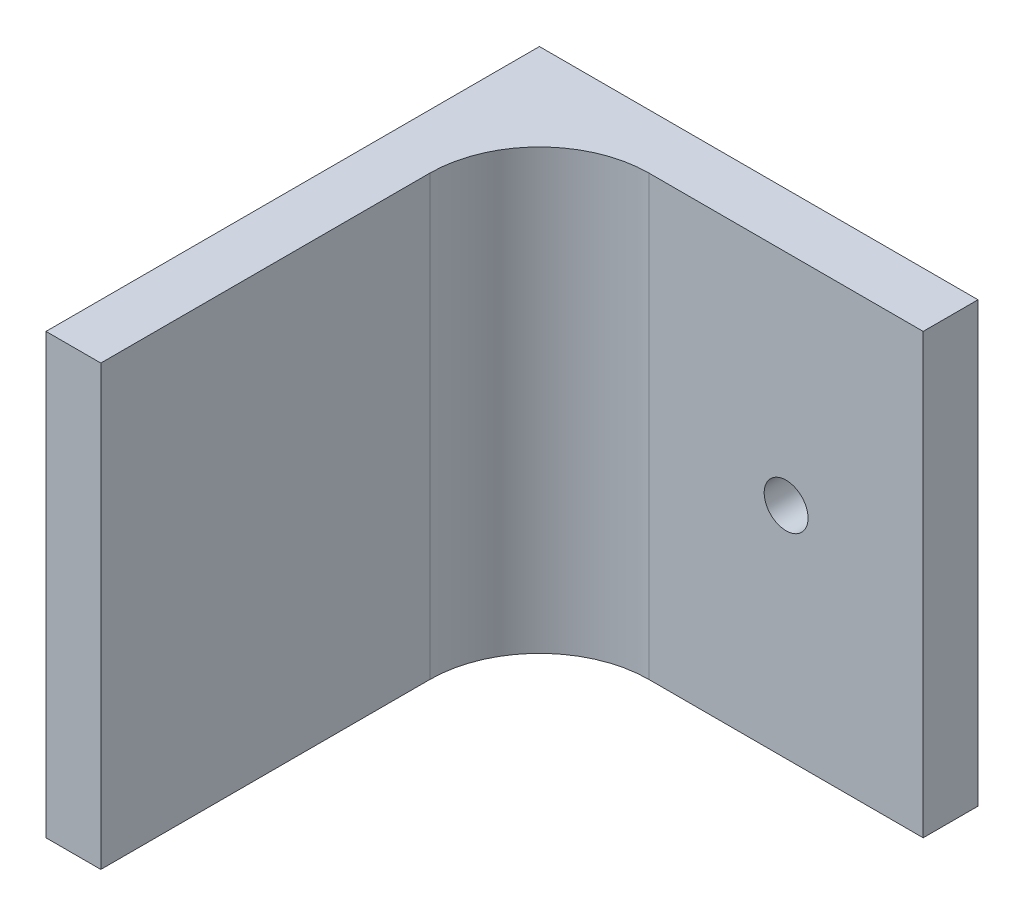
ISO-10303-21;
HEADER;
FILE_DESCRIPTION(('STEP AP214'),'2;1');
FILE_NAME('part.step','',(''),(''),'','','');
FILE_SCHEMA(('AUTOMOTIVE_DESIGN { 1 0 10303 214 1 1 1 1 }'));
ENDSEC;
DATA;
#1=APPLICATION_CONTEXT('core data for automotive mechanical design processes');
#2=APPLICATION_PROTOCOL_DEFINITION('international standard','automotive_design',2000,#1);
#3=PRODUCT_CONTEXT('',#1,'mechanical');
#4=PRODUCT('Part','Part','',(#3));
#5=PRODUCT_RELATED_PRODUCT_CATEGORY('part','',(#4));
#6=PRODUCT_DEFINITION_FORMATION('','',#4);
#7=PRODUCT_DEFINITION_CONTEXT('part definition',#1,'design');
#8=PRODUCT_DEFINITION('design','',#6,#7);
#9=PRODUCT_DEFINITION_SHAPE('','',#8);
#10=(LENGTH_UNIT() NAMED_UNIT(*) SI_UNIT(.MILLI.,.METRE.));
#11=(NAMED_UNIT(*) PLANE_ANGLE_UNIT() SI_UNIT($,.RADIAN.));
#12=(NAMED_UNIT(*) SI_UNIT($,.STERADIAN.) SOLID_ANGLE_UNIT());
#13=UNCERTAINTY_MEASURE_WITH_UNIT(LENGTH_MEASURE(1.E-05),#10,'distance_accuracy_value','');
#14=(GEOMETRIC_REPRESENTATION_CONTEXT(3) GLOBAL_UNCERTAINTY_ASSIGNED_CONTEXT((#13)) GLOBAL_UNIT_ASSIGNED_CONTEXT((#10,
#11,#12)) REPRESENTATION_CONTEXT('',''));
#15=CARTESIAN_POINT('',(0.,0.,0.));
#16=DIRECTION('',(0.,0.,1.));
#17=DIRECTION('',(1.,0.,0.));
#18=AXIS2_PLACEMENT_3D('',#15,#16,#17);
#19=CARTESIAN_POINT('',(0.,0.,2.5));
#20=DIRECTION('',(0.,0.,1.));
#21=DIRECTION('',(1.,0.,0.));
#22=AXIS2_PLACEMENT_3D('',#19,#20,#21);
#23=PLANE('',#22);
#24=CARTESIAN_POINT('',(81.7489565352814,8.48481034737446,2.5));
#25=DIRECTION('',(0.,0.,1.));
#26=DIRECTION('',(1.,0.,0.));
#27=AXIS2_PLACEMENT_3D('',#24,#25,#26);
#28=CIRCLE('',#27,0.999999999999998);
#29=CARTESIAN_POINT('',(82.7489565352814,8.48481034737446,2.5));
#30=VERTEX_POINT('',#29);
#31=EDGE_CURVE('E118',#30,#30,#28,.T.);
#32=ORIENTED_EDGE('',*,*,#31,.F.);
#33=EDGE_LOOP('',(#32));
#34=FACE_BOUND('',#33,.T.);
#35=DIRECTION('',(-1.,0.,0.));
#36=VECTOR('',#35,1.);
#37=CARTESIAN_POINT('',(67.9989565352814,18.4848103473745,2.5));
#38=LINE('',#37,#36);
#39=CARTESIAN_POINT('',(87.9989565352814,18.4848103473745,2.5));
#40=VERTEX_POINT('',#39);
#41=CARTESIAN_POINT('',(75.4989565352814,18.4848103473745,2.5));
#42=VERTEX_POINT('',#41);
#43=EDGE_CURVE('E131',#40,#42,#38,.T.);
#44=ORIENTED_EDGE('',*,*,#43,.T.);
#45=DIRECTION('',(0.,-1.,0.));
#46=VECTOR('',#45,1.);
#47=CARTESIAN_POINT('',(75.4989565352814,0.,2.5));
#48=LINE('',#47,#46);
#49=CARTESIAN_POINT('',(75.4989565352814,-1.51518965262554,2.5));
#50=VERTEX_POINT('',#49);
#51=EDGE_CURVE('E102',#42,#50,#48,.T.);
#52=ORIENTED_EDGE('',*,*,#51,.T.);
#53=DIRECTION('',(1.,0.,0.));
#54=VECTOR('',#53,1.);
#55=CARTESIAN_POINT('',(67.9989565352814,-1.51518965262554,2.5));
#56=LINE('',#55,#54);
#57=CARTESIAN_POINT('',(87.9989565352814,-1.51518965262554,2.5));
#58=VERTEX_POINT('',#57);
#59=EDGE_CURVE('E126',#50,#58,#56,.T.);
#60=ORIENTED_EDGE('',*,*,#59,.T.);
#61=DIRECTION('',(0.,1.,0.));
#62=VECTOR('',#61,1.);
#63=CARTESIAN_POINT('',(87.9989565352814,18.4848103473745,2.5));
#64=LINE('',#63,#62);
#65=EDGE_CURVE('E128',#58,#40,#64,.T.);
#66=ORIENTED_EDGE('',*,*,#65,.T.);
#67=EDGE_LOOP('',(#44,#52,#60,#66));
#68=FACE_BOUND('',#67,.T.);
#69=ADVANCED_FACE('F33',(#34,#68),#23,.T.);
#70=CARTESIAN_POINT('',(67.9989565352814,18.4848103473745,2.5));
#71=DIRECTION('',(1.,0.,0.));
#72=DIRECTION('',(0.,0.,-1.));
#73=AXIS2_PLACEMENT_3D('',#70,#71,#72);
#74=PLANE('',#73);
#75=DIRECTION('',(0.,-1.,0.));
#76=VECTOR('',#75,1.);
#77=CARTESIAN_POINT('',(67.9989565352814,18.4848103473745,0.));
#78=LINE('',#77,#76);
#79=CARTESIAN_POINT('',(67.9989565352814,18.4848103473745,0.));
#80=VERTEX_POINT('',#79);
#81=CARTESIAN_POINT('',(67.9989565352814,-1.51518965262554,0.));
#82=VERTEX_POINT('',#81);
#83=EDGE_CURVE('E101',#80,#82,#78,.T.);
#84=ORIENTED_EDGE('',*,*,#83,.T.);
#85=DIRECTION('',(0.,0.,-1.));
#86=VECTOR('',#85,1.);
#87=CARTESIAN_POINT('',(67.9989565352814,-1.51518965262554,2.5));
#88=LINE('',#87,#86);
#89=CARTESIAN_POINT('',(67.9989565352814,-1.51518965262554,22.5));
#90=VERTEX_POINT('',#89);
#91=EDGE_CURVE('E94',#90,#82,#88,.T.);
#92=ORIENTED_EDGE('',*,*,#91,.F.);
#93=DIRECTION('',(0.,-1.,0.));
#94=VECTOR('',#93,1.);
#95=CARTESIAN_POINT('',(67.9989565352814,-1.51518965262554,22.5));
#96=LINE('',#95,#94);
#97=CARTESIAN_POINT('',(67.9989565352814,18.4848103473745,22.5));
#98=VERTEX_POINT('',#97);
#99=EDGE_CURVE('E99',#98,#90,#96,.T.);
#100=ORIENTED_EDGE('',*,*,#99,.F.);
#101=DIRECTION('',(0.,0.,-1.));
#102=VECTOR('',#101,1.);
#103=CARTESIAN_POINT('',(67.9989565352814,18.4848103473745,2.5));
#104=LINE('',#103,#102);
#105=EDGE_CURVE('E134',#98,#80,#104,.T.);
#106=ORIENTED_EDGE('',*,*,#105,.T.);
#107=EDGE_LOOP('',(#84,#92,#100,#106));
#108=FACE_BOUND('',#107,.T.);
#109=ADVANCED_FACE('F96',(#108),#74,.F.);
#110=CARTESIAN_POINT('',(67.9989565352814,-1.51518965262554,2.5));
#111=DIRECTION('',(0.,1.,0.));
#112=DIRECTION('',(-1.,0.,0.));
#113=AXIS2_PLACEMENT_3D('',#110,#111,#112);
#114=PLANE('',#113);
#115=DIRECTION('',(1.,0.,0.));
#116=VECTOR('',#115,1.);
#117=CARTESIAN_POINT('',(67.9989565352814,-1.51518965262554,0.));
#118=LINE('',#117,#116);
#119=CARTESIAN_POINT('',(87.9989565352814,-1.51518965262554,0.));
#120=VERTEX_POINT('',#119);
#121=EDGE_CURVE('E136',#82,#120,#118,.T.);
#122=ORIENTED_EDGE('',*,*,#121,.T.);
#123=DIRECTION('',(0.,0.,-1.));
#124=VECTOR('',#123,1.);
#125=CARTESIAN_POINT('',(87.9989565352814,-1.51518965262554,2.5));
#126=LINE('',#125,#124);
#127=EDGE_CURVE('E103',#58,#120,#126,.T.);
#128=ORIENTED_EDGE('',*,*,#127,.F.);
#129=ORIENTED_EDGE('',*,*,#59,.F.);
#130=CARTESIAN_POINT('',(75.4989565352814,-1.51518965262554,7.5));
#131=DIRECTION('',(0.,1.,0.));
#132=DIRECTION('',(-1.,0.,0.));
#133=AXIS2_PLACEMENT_3D('',#130,#131,#132);
#134=CIRCLE('',#133,5.);
#135=CARTESIAN_POINT('',(70.4989565352814,-1.51518965262554,7.5));
#136=VERTEX_POINT('',#135);
#137=EDGE_CURVE('E42',#50,#136,#134,.T.);
#138=ORIENTED_EDGE('',*,*,#137,.T.);
#139=DIRECTION('',(0.,0.,-1.));
#140=VECTOR('',#139,1.);
#141=CARTESIAN_POINT('',(70.4989565352814,-1.51518965262554,22.5));
#142=LINE('',#141,#140);
#143=CARTESIAN_POINT('',(70.4989565352814,-1.51518965262554,22.5));
#144=VERTEX_POINT('',#143);
#145=EDGE_CURVE('E107',#144,#136,#142,.T.);
#146=ORIENTED_EDGE('',*,*,#145,.F.);
#147=DIRECTION('',(1.,0.,0.));
#148=VECTOR('',#147,1.);
#149=CARTESIAN_POINT('',(67.9989565352814,-1.51518965262554,22.5));
#150=LINE('',#149,#148);
#151=EDGE_CURVE('E105',#90,#144,#150,.T.);
#152=ORIENTED_EDGE('',*,*,#151,.F.);
#153=ORIENTED_EDGE('',*,*,#91,.T.);
#154=EDGE_LOOP('',(#122,#128,#129,#138,#146,#152,#153));
#155=FACE_BOUND('',#154,.T.);
#156=ADVANCED_FACE('F106',(#155),#114,.F.);
#157=CARTESIAN_POINT('',(87.9989565352814,18.4848103473745,2.5));
#158=DIRECTION('',(-1.,0.,0.));
#159=DIRECTION('',(0.,0.,1.));
#160=AXIS2_PLACEMENT_3D('',#157,#158,#159);
#161=PLANE('',#160);
#162=DIRECTION('',(0.,1.,0.));
#163=VECTOR('',#162,1.);
#164=CARTESIAN_POINT('',(87.9989565352814,18.4848103473745,0.));
#165=LINE('',#164,#163);
#166=CARTESIAN_POINT('',(87.9989565352814,18.4848103473745,0.));
#167=VERTEX_POINT('',#166);
#168=EDGE_CURVE('E138',#120,#167,#165,.T.);
#169=ORIENTED_EDGE('',*,*,#168,.T.);
#170=DIRECTION('',(0.,0.,-1.));
#171=VECTOR('',#170,1.);
#172=CARTESIAN_POINT('',(87.9989565352814,18.4848103473745,2.5));
#173=LINE('',#172,#171);
#174=EDGE_CURVE('E142',#40,#167,#173,.T.);
#175=ORIENTED_EDGE('',*,*,#174,.F.);
#176=ORIENTED_EDGE('',*,*,#65,.F.);
#177=ORIENTED_EDGE('',*,*,#127,.T.);
#178=EDGE_LOOP('',(#169,#175,#176,#177));
#179=FACE_BOUND('',#178,.T.);
#180=ADVANCED_FACE('F160',(#179),#161,.F.);
#181=CARTESIAN_POINT('',(67.9989565352814,18.4848103473745,2.5));
#182=DIRECTION('',(0.,-1.,0.));
#183=DIRECTION('',(0.,0.,-1.));
#184=AXIS2_PLACEMENT_3D('',#181,#182,#183);
#185=PLANE('',#184);
#186=ORIENTED_EDGE('',*,*,#105,.F.);
#187=DIRECTION('',(-1.,0.,0.));
#188=VECTOR('',#187,1.);
#189=CARTESIAN_POINT('',(67.9989565352814,18.4848103473745,22.5));
#190=LINE('',#189,#188);
#191=CARTESIAN_POINT('',(70.4989565352814,18.4848103473745,22.5));
#192=VERTEX_POINT('',#191);
#193=EDGE_CURVE('E115',#192,#98,#190,.T.);
#194=ORIENTED_EDGE('',*,*,#193,.F.);
#195=DIRECTION('',(0.,0.,-1.));
#196=VECTOR('',#195,1.);
#197=CARTESIAN_POINT('',(70.4989565352814,18.4848103473745,22.5));
#198=LINE('',#197,#196);
#199=CARTESIAN_POINT('',(70.4989565352814,18.4848103473745,7.5));
#200=VERTEX_POINT('',#199);
#201=EDGE_CURVE('E123',#192,#200,#198,.T.);
#202=ORIENTED_EDGE('',*,*,#201,.T.);
#203=CARTESIAN_POINT('',(75.4989565352814,18.4848103473745,7.5));
#204=DIRECTION('',(0.,-1.,0.));
#205=DIRECTION('',(0.,0.,-1.));
#206=AXIS2_PLACEMENT_3D('',#203,#204,#205);
#207=CIRCLE('',#206,5.);
#208=EDGE_CURVE('E11',#200,#42,#207,.T.);
#209=ORIENTED_EDGE('',*,*,#208,.T.);
#210=ORIENTED_EDGE('',*,*,#43,.F.);
#211=ORIENTED_EDGE('',*,*,#174,.T.);
#212=DIRECTION('',(-1.,0.,0.));
#213=VECTOR('',#212,1.);
#214=CARTESIAN_POINT('',(67.9989565352814,18.4848103473745,0.));
#215=LINE('',#214,#213);
#216=EDGE_CURVE('E129',#167,#80,#215,.T.);
#217=ORIENTED_EDGE('',*,*,#216,.T.);
#218=EDGE_LOOP('',(#186,#194,#202,#209,#210,#211,#217));
#219=FACE_BOUND('',#218,.T.);
#220=ADVANCED_FACE('F163',(#219),#185,.F.);
#221=CARTESIAN_POINT('',(0.,0.,0.));
#222=DIRECTION('',(0.,0.,1.));
#223=DIRECTION('',(1.,0.,0.));
#224=AXIS2_PLACEMENT_3D('',#221,#222,#223);
#225=PLANE('',#224);
#226=CARTESIAN_POINT('',(81.7489565352814,8.48481034737446,0.));
#227=DIRECTION('',(0.,0.,1.));
#228=DIRECTION('',(1.,0.,0.));
#229=AXIS2_PLACEMENT_3D('',#226,#227,#228);
#230=CIRCLE('',#229,0.999999999999998);
#231=CARTESIAN_POINT('',(82.7489565352814,8.48481034737446,0.));
#232=VERTEX_POINT('',#231);
#233=EDGE_CURVE('E37',#232,#232,#230,.T.);
#234=ORIENTED_EDGE('',*,*,#233,.T.);
#235=EDGE_LOOP('',(#234));
#236=FACE_BOUND('',#235,.T.);
#237=ORIENTED_EDGE('',*,*,#83,.F.);
#238=ORIENTED_EDGE('',*,*,#216,.F.);
#239=ORIENTED_EDGE('',*,*,#168,.F.);
#240=ORIENTED_EDGE('',*,*,#121,.F.);
#241=EDGE_LOOP('',(#237,#238,#239,#240));
#242=FACE_BOUND('',#241,.T.);
#243=ADVANCED_FACE('F183',(#236,#242),#225,.F.);
#244=CARTESIAN_POINT('',(70.4989565352814,-1.51518965262554,22.5));
#245=DIRECTION('',(-1.,0.,0.));
#246=DIRECTION('',(0.,0.,1.));
#247=AXIS2_PLACEMENT_3D('',#244,#245,#246);
#248=PLANE('',#247);
#249=ORIENTED_EDGE('',*,*,#145,.T.);
#250=DIRECTION('',(0.,-1.,0.));
#251=VECTOR('',#250,1.);
#252=CARTESIAN_POINT('',(70.4989565352814,-1.51518965262554,7.5));
#253=LINE('',#252,#251);
#254=EDGE_CURVE('E55',#136,#200,#253,.F.);
#255=ORIENTED_EDGE('',*,*,#254,.T.);
#256=ORIENTED_EDGE('',*,*,#201,.F.);
#257=DIRECTION('',(0.,1.,0.));
#258=VECTOR('',#257,1.);
#259=CARTESIAN_POINT('',(70.4989565352814,-1.51518965262554,22.5));
#260=LINE('',#259,#258);
#261=EDGE_CURVE('E110',#144,#192,#260,.T.);
#262=ORIENTED_EDGE('',*,*,#261,.F.);
#263=EDGE_LOOP('',(#249,#255,#256,#262));
#264=FACE_BOUND('',#263,.T.);
#265=ADVANCED_FACE('F172',(#264),#248,.F.);
#266=CARTESIAN_POINT('',(0.,0.,22.5));
#267=DIRECTION('',(0.,0.,-1.));
#268=DIRECTION('',(-1.,0.,0.));
#269=AXIS2_PLACEMENT_3D('',#266,#267,#268);
#270=PLANE('',#269);
#271=ORIENTED_EDGE('',*,*,#99,.T.);
#272=ORIENTED_EDGE('',*,*,#151,.T.);
#273=ORIENTED_EDGE('',*,*,#261,.T.);
#274=ORIENTED_EDGE('',*,*,#193,.T.);
#275=EDGE_LOOP('',(#271,#272,#273,#274));
#276=FACE_BOUND('',#275,.T.);
#277=ADVANCED_FACE('F113',(#276),#270,.F.);
#278=CARTESIAN_POINT('',(75.4989565352814,0.,7.5));
#279=DIRECTION('',(0.,-1.,0.));
#280=DIRECTION('',(0.,0.,-1.));
#281=AXIS2_PLACEMENT_3D('',#278,#279,#280);
#282=CYLINDRICAL_SURFACE('',#281,5.);
#283=ORIENTED_EDGE('',*,*,#208,.F.);
#284=ORIENTED_EDGE('',*,*,#254,.F.);
#285=ORIENTED_EDGE('',*,*,#137,.F.);
#286=ORIENTED_EDGE('',*,*,#51,.F.);
#287=EDGE_LOOP('',(#283,#284,#285,#286));
#288=FACE_BOUND('',#287,.T.);
#289=ADVANCED_FACE('F35',(#288),#282,.F.);
#290=CARTESIAN_POINT('',(81.7489565352814,8.48481034737446,-20.));
#291=DIRECTION('',(0.,0.,1.));
#292=DIRECTION('',(1.,0.,0.));
#293=AXIS2_PLACEMENT_3D('',#290,#291,#292);
#294=CYLINDRICAL_SURFACE('',#293,0.999999999999998);
#295=ORIENTED_EDGE('',*,*,#31,.T.);
#296=EDGE_LOOP('',(#295));
#297=FACE_BOUND('',#296,.T.);
#298=ORIENTED_EDGE('',*,*,#233,.F.);
#299=EDGE_LOOP('',(#298));
#300=FACE_BOUND('',#299,.T.);
#301=ADVANCED_FACE('F165',(#297,#300),#294,.F.);
#302=CLOSED_SHELL('',(#69,#109,#156,#180,#220,#243,#265,#277,#289,#301));
#303=MANIFOLD_SOLID_BREP('B2',#302);
#304=ADVANCED_BREP_SHAPE_REPRESENTATION('',(#18,#303),#14);
#305=SHAPE_DEFINITION_REPRESENTATION(#9,#304);
ENDSEC;
END-ISO-10303-21;
